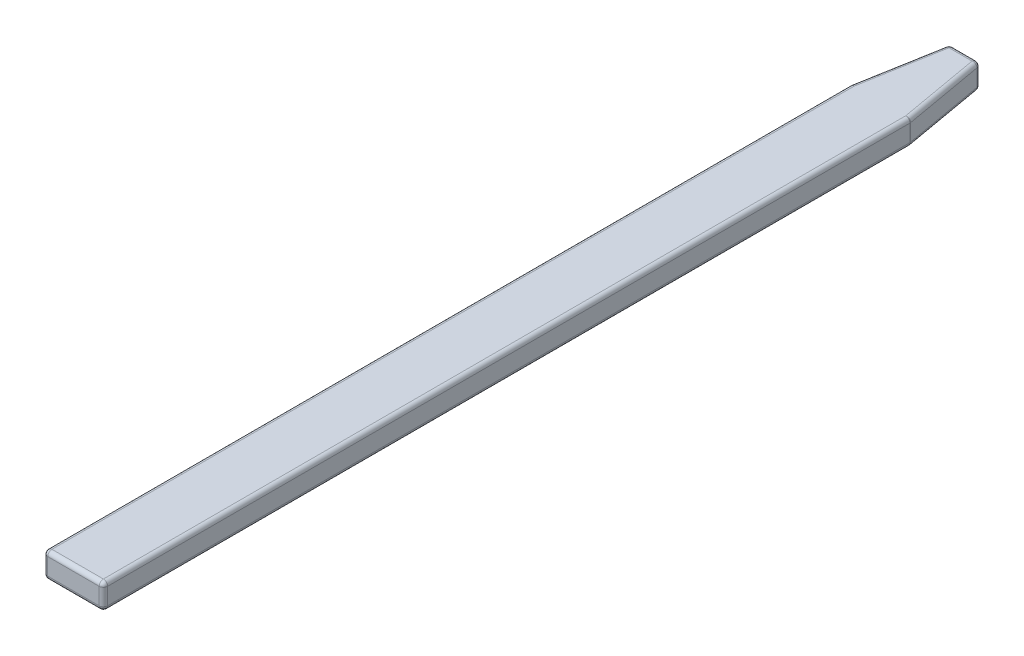
ISO-10303-21;
HEADER;
FILE_DESCRIPTION(('STEP AP214'),'2;1');
FILE_NAME('part.step','',(''),(''),'','','');
FILE_SCHEMA(('AUTOMOTIVE_DESIGN { 1 0 10303 214 1 1 1 1 }'));
ENDSEC;
DATA;
#1=APPLICATION_CONTEXT('core data for automotive mechanical design processes');
#2=APPLICATION_PROTOCOL_DEFINITION('international standard','automotive_design',2000,#1);
#3=PRODUCT_CONTEXT('',#1,'mechanical');
#4=PRODUCT('Part','Part','',(#3));
#5=PRODUCT_RELATED_PRODUCT_CATEGORY('part','',(#4));
#6=PRODUCT_DEFINITION_FORMATION('','',#4);
#7=PRODUCT_DEFINITION_CONTEXT('part definition',#1,'design');
#8=PRODUCT_DEFINITION('design','',#6,#7);
#9=PRODUCT_DEFINITION_SHAPE('','',#8);
#10=(LENGTH_UNIT() NAMED_UNIT(*) SI_UNIT(.MILLI.,.METRE.));
#11=(NAMED_UNIT(*) PLANE_ANGLE_UNIT() SI_UNIT($,.RADIAN.));
#12=(NAMED_UNIT(*) SI_UNIT($,.STERADIAN.) SOLID_ANGLE_UNIT());
#13=UNCERTAINTY_MEASURE_WITH_UNIT(LENGTH_MEASURE(1.E-05),#10,'distance_accuracy_value','');
#14=(GEOMETRIC_REPRESENTATION_CONTEXT(3) GLOBAL_UNCERTAINTY_ASSIGNED_CONTEXT((#13)) GLOBAL_UNIT_ASSIGNED_CONTEXT((#10,
#11,#12)) REPRESENTATION_CONTEXT('',''));
#15=CARTESIAN_POINT('',(0.,0.,0.));
#16=DIRECTION('',(0.,0.,1.));
#17=DIRECTION('',(1.,0.,0.));
#18=AXIS2_PLACEMENT_3D('',#15,#16,#17);
#19=CARTESIAN_POINT('',(-0.305000000000003,0.0999469366672912,-2.50962556682371));
#20=DIRECTION('',(0.,0.,1.));
#21=DIRECTION('',(1.,0.,0.));
#22=AXIS2_PLACEMENT_3D('',#19,#20,#21);
#23=SPHERICAL_SURFACE('',#22,0.05);
#24=CARTESIAN_POINT('',(-0.305000000000003,0.0999469366672912,-2.5096255668237));
#25=DIRECTION('',(0.,0.,-1.));
#26=DIRECTION('',(0.,1.,0.));
#27=AXIS2_PLACEMENT_3D('',#24,#25,#26);
#28=CIRCLE('',#27,0.05);
#29=CARTESIAN_POINT('',(-0.355000000000003,0.0999469366672913,-2.50962556682371));
#30=VERTEX_POINT('',#29);
#31=CARTESIAN_POINT('',(-0.305000000000003,0.149946936667291,-2.50962556682371));
#32=VERTEX_POINT('',#31);
#33=EDGE_CURVE('E11',#30,#32,#28,.T.);
#34=ORIENTED_EDGE('',*,*,#33,.T.);
#35=CARTESIAN_POINT('',(-0.305000000000003,0.0999469366672912,-2.50962556682371));
#36=DIRECTION('',(-0.173648177666919,0.,0.98480775301221));
#37=DIRECTION('',(-0.98480775301221,0.,-0.173648177666919));
#38=AXIS2_PLACEMENT_3D('',#35,#36,#37);
#39=CIRCLE('',#38,0.05);
#40=CARTESIAN_POINT('',(-0.354240387650613,0.0999469366672912,-2.51830797570705));
#41=VERTEX_POINT('',#40);
#42=EDGE_CURVE('E24',#32,#41,#39,.T.);
#43=ORIENTED_EDGE('',*,*,#42,.T.);
#44=CARTESIAN_POINT('',(-0.305000000000003,0.0999469366672912,-2.50962556682371));
#45=DIRECTION('',(0.,1.,0.));
#46=DIRECTION('',(-1.,0.,0.));
#47=AXIS2_PLACEMENT_3D('',#44,#45,#46);
#48=CIRCLE('',#47,0.0499999999999999);
#49=EDGE_CURVE('E284',#41,#30,#48,.T.);
#50=ORIENTED_EDGE('',*,*,#49,.T.);
#51=EDGE_LOOP('',(#34,#43,#50));
#52=FACE_BOUND('',#51,.T.);
#53=ADVANCED_FACE('F17',(#52),#23,.T.);
#54=CARTESIAN_POINT('',(-0.136718037732674,0.0999469366672912,-3.464));
#55=DIRECTION('',(-0.351334189452769,-0.837407564962996,-0.418703782481496));
#56=DIRECTION('',(-0.538275207016001,0.54657896972235,-0.641491411765688));
#57=AXIS2_PLACEMENT_3D('',#54,#55,#56);
#58=SPHERICAL_SURFACE('',#57,0.05);
#59=CARTESIAN_POINT('',(-0.136718037732674,0.0999469366672912,-3.464));
#60=DIRECTION('',(0.,1.,0.));
#61=DIRECTION('',(-0.984807753012208,0.,-0.17364817766693));
#62=AXIS2_PLACEMENT_3D('',#59,#60,#61);
#63=CIRCLE('',#62,0.05);
#64=CARTESIAN_POINT('',(-0.136718037732674,0.0999469366672912,-3.514));
#65=VERTEX_POINT('',#64);
#66=CARTESIAN_POINT('',(-0.185958425383284,0.0999469366672912,-3.47268240888335));
#67=VERTEX_POINT('',#66);
#68=EDGE_CURVE('E282',#65,#67,#63,.T.);
#69=ORIENTED_EDGE('',*,*,#68,.T.);
#70=CARTESIAN_POINT('',(-0.136718037732674,0.0999469366672912,-3.464));
#71=DIRECTION('',(0.17364817766694,0.,-0.984807753012206));
#72=DIRECTION('',(0.,1.,0.));
#73=AXIS2_PLACEMENT_3D('',#70,#71,#72);
#74=CIRCLE('',#73,0.05);
#75=CARTESIAN_POINT('',(-0.136718037732674,0.149946936667291,-3.464));
#76=VERTEX_POINT('',#75);
#77=EDGE_CURVE('E280',#67,#76,#74,.T.);
#78=ORIENTED_EDGE('',*,*,#77,.T.);
#79=CARTESIAN_POINT('',(-0.136718037732674,0.0999469366672912,-3.464));
#80=DIRECTION('',(-1.,0.,0.));
#81=DIRECTION('',(0.,0.,-1.));
#82=AXIS2_PLACEMENT_3D('',#79,#80,#81);
#83=CIRCLE('',#82,0.05);
#84=EDGE_CURVE('E277',#76,#65,#83,.T.);
#85=ORIENTED_EDGE('',*,*,#84,.T.);
#86=EDGE_LOOP('',(#69,#78,#85));
#87=FACE_BOUND('',#86,.T.);
#88=ADVANCED_FACE('F448',(#87),#58,.T.);
#89=CARTESIAN_POINT('',(-1.10906299365398,0.0999469366672912,2.0504422709135));
#90=DIRECTION('',(-0.17364817766693,0.,0.984807753012208));
#91=DIRECTION('',(-0.696364240320019,0.707106781186548,-0.122787803968973));
#92=AXIS2_PLACEMENT_3D('',#89,#90,#91);
#93=CYLINDRICAL_SURFACE('',#92,0.05);
#94=ORIENTED_EDGE('',*,*,#42,.F.);
#95=DIRECTION('',(0.17364817766693,0.,-0.984807753012208));
#96=VECTOR('',#95,1.);
#97=CARTESIAN_POINT('',(-1.10906299365398,0.149946936667291,2.0504422709135));
#98=LINE('',#97,#96);
#99=EDGE_CURVE('E274',#32,#76,#98,.T.);
#100=ORIENTED_EDGE('',*,*,#99,.T.);
#101=ORIENTED_EDGE('',*,*,#77,.F.);
#102=DIRECTION('',(-0.17364817766693,0.,0.984807753012208));
#103=VECTOR('',#102,1.);
#104=CARTESIAN_POINT('',(-1.15830338130459,0.0999469366672912,2.04175986203016));
#105=LINE('',#104,#103);
#106=EDGE_CURVE('E271',#67,#41,#105,.T.);
#107=ORIENTED_EDGE('',*,*,#106,.T.);
#108=EDGE_LOOP('',(#94,#100,#101,#107));
#109=FACE_BOUND('',#108,.T.);
#110=ADVANCED_FACE('F300',(#109),#93,.T.);
#111=CARTESIAN_POINT('',(-0.305000000000003,-0.100053063332709,-2.5096255668237));
#112=DIRECTION('',(0.,0.,1.));
#113=DIRECTION('',(1.,0.,0.));
#114=AXIS2_PLACEMENT_3D('',#111,#112,#113);
#115=SPHERICAL_SURFACE('',#114,0.05);
#116=CARTESIAN_POINT('',(-0.305000000000003,-0.100053063332709,-2.50962556682371));
#117=DIRECTION('',(-0.173648177666918,0.,0.98480775301221));
#118=DIRECTION('',(0.,-1.,0.));
#119=AXIS2_PLACEMENT_3D('',#116,#117,#118);
#120=CIRCLE('',#119,0.05);
#121=CARTESIAN_POINT('',(-0.354240387650613,-0.100053063332709,-2.51830797570705));
#122=VERTEX_POINT('',#121);
#123=CARTESIAN_POINT('',(-0.305000000000003,-0.150053063332709,-2.5096255668237));
#124=VERTEX_POINT('',#123);
#125=EDGE_CURVE('E269',#122,#124,#120,.T.);
#126=ORIENTED_EDGE('',*,*,#125,.T.);
#127=CARTESIAN_POINT('',(-0.305000000000003,-0.100053063332709,-2.5096255668237));
#128=DIRECTION('',(0.,0.,-1.));
#129=DIRECTION('',(-1.,0.,0.));
#130=AXIS2_PLACEMENT_3D('',#127,#128,#129);
#131=CIRCLE('',#130,0.05);
#132=CARTESIAN_POINT('',(-0.355000000000003,-0.100053063332709,-2.5096255668237));
#133=VERTEX_POINT('',#132);
#134=EDGE_CURVE('E267',#124,#133,#131,.T.);
#135=ORIENTED_EDGE('',*,*,#134,.T.);
#136=CARTESIAN_POINT('',(-0.305000000000003,-0.100053063332709,-2.5096255668237));
#137=DIRECTION('',(0.,-1.,0.));
#138=DIRECTION('',(-0.984807753012208,0.,-0.173648177666929));
#139=AXIS2_PLACEMENT_3D('',#136,#137,#138);
#140=CIRCLE('',#139,0.0500000000000001);
#141=EDGE_CURVE('E264',#133,#122,#140,.T.);
#142=ORIENTED_EDGE('',*,*,#141,.T.);
#143=EDGE_LOOP('',(#126,#135,#142));
#144=FACE_BOUND('',#143,.T.);
#145=ADVANCED_FACE('F436',(#144),#115,.T.);
#146=CARTESIAN_POINT('',(-0.305000000000003,0.0999469366672912,7.006));
#147=DIRECTION('',(-0.816496580927727,-0.408248290463864,-0.40824829046386));
#148=DIRECTION('',(-0.577350269189624,0.577350269189628,0.577350269189625));
#149=AXIS2_PLACEMENT_3D('',#146,#147,#148);
#150=SPHERICAL_SURFACE('',#149,0.05);
#151=CARTESIAN_POINT('',(-0.305000000000003,0.0999469366672912,7.006));
#152=DIRECTION('',(-1.,0.,0.));
#153=DIRECTION('',(0.,1.,0.));
#154=AXIS2_PLACEMENT_3D('',#151,#152,#153);
#155=CIRCLE('',#154,0.05);
#156=CARTESIAN_POINT('',(-0.305000000000003,0.0999469366672912,7.056));
#157=VERTEX_POINT('',#156);
#158=CARTESIAN_POINT('',(-0.305000000000003,0.149946936667291,7.006));
#159=VERTEX_POINT('',#158);
#160=EDGE_CURVE('E262',#157,#159,#155,.T.);
#161=ORIENTED_EDGE('',*,*,#160,.T.);
#162=CARTESIAN_POINT('',(-0.305000000000003,0.0999469366672912,7.006));
#163=DIRECTION('',(0.,0.,1.));
#164=DIRECTION('',(-1.,0.,0.));
#165=AXIS2_PLACEMENT_3D('',#162,#163,#164);
#166=CIRCLE('',#165,0.05);
#167=CARTESIAN_POINT('',(-0.355000000000003,0.0999469366672913,7.006));
#168=VERTEX_POINT('',#167);
#169=EDGE_CURVE('E260',#159,#168,#166,.T.);
#170=ORIENTED_EDGE('',*,*,#169,.T.);
#171=CARTESIAN_POINT('',(-0.305000000000003,0.0999469366672912,7.006));
#172=DIRECTION('',(0.,1.,0.));
#173=DIRECTION('',(0.,0.,1.));
#174=AXIS2_PLACEMENT_3D('',#171,#172,#173);
#175=CIRCLE('',#174,0.05);
#176=EDGE_CURVE('E257',#168,#157,#175,.T.);
#177=ORIENTED_EDGE('',*,*,#176,.T.);
#178=EDGE_LOOP('',(#161,#170,#177));
#179=FACE_BOUND('',#178,.T.);
#180=ADVANCED_FACE('F434',(#179),#150,.T.);
#181=CARTESIAN_POINT('',(-0.305000000000003,0.0999469366672912,7.006));
#182=DIRECTION('',(0.,0.,-1.));
#183=DIRECTION('',(-0.707106781186547,0.707106781186548,0.));
#184=AXIS2_PLACEMENT_3D('',#181,#182,#183);
#185=CYLINDRICAL_SURFACE('',#184,0.05);
#186=ORIENTED_EDGE('',*,*,#33,.F.);
#187=DIRECTION('',(0.,0.,1.));
#188=VECTOR('',#187,1.);
#189=CARTESIAN_POINT('',(-0.355000000000003,0.0999469366672913,7.006));
#190=LINE('',#189,#188);
#191=EDGE_CURVE('E255',#30,#168,#190,.T.);
#192=ORIENTED_EDGE('',*,*,#191,.T.);
#193=ORIENTED_EDGE('',*,*,#169,.F.);
#194=DIRECTION('',(0.,0.,-1.));
#195=VECTOR('',#194,1.);
#196=CARTESIAN_POINT('',(-0.305000000000003,0.149946936667291,7.006));
#197=LINE('',#196,#195);
#198=EDGE_CURVE('E253',#159,#32,#197,.T.);
#199=ORIENTED_EDGE('',*,*,#198,.T.);
#200=EDGE_LOOP('',(#186,#192,#193,#199));
#201=FACE_BOUND('',#200,.T.);
#202=ADVANCED_FACE('F432',(#201),#185,.T.);
#203=CARTESIAN_POINT('',(-0.136718037732674,-0.100053063332709,-3.464));
#204=DIRECTION('',(0.351334189452759,-0.837407564963,0.418703782481496));
#205=DIRECTION('',(-0.538275207015996,-0.546578969722344,-0.641491411765698));
#206=AXIS2_PLACEMENT_3D('',#203,#204,#205);
#207=SPHERICAL_SURFACE('',#206,0.05);
#208=CARTESIAN_POINT('',(-0.136718037732674,-0.100053063332709,-3.464));
#209=DIRECTION('',(0.,-1.,0.));
#210=DIRECTION('',(0.,0.,-1.));
#211=AXIS2_PLACEMENT_3D('',#208,#209,#210);
#212=CIRCLE('',#211,0.05);
#213=CARTESIAN_POINT('',(-0.185958425383285,-0.100053063332709,-3.47268240888335));
#214=VERTEX_POINT('',#213);
#215=CARTESIAN_POINT('',(-0.136718037732674,-0.100053063332709,-3.514));
#216=VERTEX_POINT('',#215);
#217=EDGE_CURVE('E251',#214,#216,#212,.T.);
#218=ORIENTED_EDGE('',*,*,#217,.T.);
#219=CARTESIAN_POINT('',(-0.136718037732674,-0.100053063332709,-3.464));
#220=DIRECTION('',(-1.,0.,0.));
#221=DIRECTION('',(0.,-1.,0.));
#222=AXIS2_PLACEMENT_3D('',#219,#220,#221);
#223=CIRCLE('',#222,0.05);
#224=CARTESIAN_POINT('',(-0.136718037732674,-0.150053063332709,-3.464));
#225=VERTEX_POINT('',#224);
#226=EDGE_CURVE('E249',#216,#225,#223,.T.);
#227=ORIENTED_EDGE('',*,*,#226,.T.);
#228=CARTESIAN_POINT('',(-0.136718037732674,-0.100053063332709,-3.464));
#229=DIRECTION('',(0.173648177666929,0.,-0.984807753012208));
#230=DIRECTION('',(-0.984807753012208,0.,-0.173648177666929));
#231=AXIS2_PLACEMENT_3D('',#228,#229,#230);
#232=CIRCLE('',#231,0.0500000000000002);
#233=EDGE_CURVE('E246',#225,#214,#232,.T.);
#234=ORIENTED_EDGE('',*,*,#233,.T.);
#235=EDGE_LOOP('',(#218,#227,#234));
#236=FACE_BOUND('',#235,.T.);
#237=ADVANCED_FACE('F443',(#236),#207,.T.);
#238=CARTESIAN_POINT('',(0.136718037732668,0.0999469366672912,-3.464));
#239=DIRECTION('',(0.351334189452757,-0.837407564962997,-0.418703782481504));
#240=DIRECTION('',(0.538275207015987,0.546578969722349,-0.641491411765701));
#241=AXIS2_PLACEMENT_3D('',#238,#239,#240);
#242=SPHERICAL_SURFACE('',#241,0.05);
#243=CARTESIAN_POINT('',(0.136718037732668,0.0999469366672912,-3.464));
#244=DIRECTION('',(0.,1.,0.));
#245=DIRECTION('',(0.,0.,-1.));
#246=AXIS2_PLACEMENT_3D('',#243,#244,#245);
#247=CIRCLE('',#246,0.05);
#248=CARTESIAN_POINT('',(0.185958425383278,0.0999469366672912,-3.47268240888335));
#249=VERTEX_POINT('',#248);
#250=CARTESIAN_POINT('',(0.136718037732668,0.0999469366672912,-3.514));
#251=VERTEX_POINT('',#250);
#252=EDGE_CURVE('E244',#249,#251,#247,.T.);
#253=ORIENTED_EDGE('',*,*,#252,.T.);
#254=CARTESIAN_POINT('',(0.136718037732668,0.0999469366672912,-3.464));
#255=DIRECTION('',(1.,0.,0.));
#256=DIRECTION('',(0.,1.,0.));
#257=AXIS2_PLACEMENT_3D('',#254,#255,#256);
#258=CIRCLE('',#257,0.05);
#259=CARTESIAN_POINT('',(0.136718037732668,0.149946936667291,-3.464));
#260=VERTEX_POINT('',#259);
#261=EDGE_CURVE('E242',#251,#260,#258,.T.);
#262=ORIENTED_EDGE('',*,*,#261,.T.);
#263=CARTESIAN_POINT('',(0.136718037732668,0.0999469366672912,-3.464));
#264=DIRECTION('',(-0.17364817766692,0.,-0.98480775301221));
#265=DIRECTION('',(0.98480775301221,0.,-0.17364817766692));
#266=AXIS2_PLACEMENT_3D('',#263,#264,#265);
#267=CIRCLE('',#266,0.0499999999999997);
#268=EDGE_CURVE('E239',#260,#249,#267,.T.);
#269=ORIENTED_EDGE('',*,*,#268,.T.);
#270=EDGE_LOOP('',(#253,#262,#269));
#271=FACE_BOUND('',#270,.T.);
#272=ADVANCED_FACE('F462',(#271),#242,.T.);
#273=CARTESIAN_POINT('',(-0.947500000000003,0.0999469366672912,-3.464));
#274=DIRECTION('',(-1.,0.,0.));
#275=DIRECTION('',(0.,0.707106781186547,-0.707106781186548));
#276=AXIS2_PLACEMENT_3D('',#273,#274,#275);
#277=CYLINDRICAL_SURFACE('',#276,0.05);
#278=ORIENTED_EDGE('',*,*,#84,.F.);
#279=DIRECTION('',(1.,0.,0.));
#280=VECTOR('',#279,1.);
#281=CARTESIAN_POINT('',(-0.947500000000003,0.149946936667291,-3.464));
#282=LINE('',#281,#280);
#283=EDGE_CURVE('E236',#76,#260,#282,.T.);
#284=ORIENTED_EDGE('',*,*,#283,.T.);
#285=ORIENTED_EDGE('',*,*,#261,.F.);
#286=DIRECTION('',(-1.,0.,0.));
#287=VECTOR('',#286,1.);
#288=CARTESIAN_POINT('',(-0.947500000000003,0.0999469366672912,-3.514));
#289=LINE('',#288,#287);
#290=EDGE_CURVE('E233',#251,#65,#289,.T.);
#291=ORIENTED_EDGE('',*,*,#290,.T.);
#292=EDGE_LOOP('',(#278,#284,#285,#291));
#293=FACE_BOUND('',#292,.T.);
#294=ADVANCED_FACE('F467',(#293),#277,.T.);
#295=CARTESIAN_POINT('',(-0.305000000000003,-0.100053063332709,7.006));
#296=DIRECTION('',(0.408248290463863,-0.816496580927727,-0.40824829046386));
#297=DIRECTION('',(-0.577350269189628,-0.577350269189624,0.577350269189625));
#298=AXIS2_PLACEMENT_3D('',#295,#296,#297);
#299=SPHERICAL_SURFACE('',#298,0.05);
#300=CARTESIAN_POINT('',(-0.305000000000003,-0.100053063332709,7.006));
#301=DIRECTION('',(0.,-1.,0.));
#302=DIRECTION('',(-1.,0.,0.));
#303=AXIS2_PLACEMENT_3D('',#300,#301,#302);
#304=CIRCLE('',#303,0.05);
#305=CARTESIAN_POINT('',(-0.305000000000003,-0.100053063332709,7.056));
#306=VERTEX_POINT('',#305);
#307=CARTESIAN_POINT('',(-0.355000000000003,-0.100053063332709,7.006));
#308=VERTEX_POINT('',#307);
#309=EDGE_CURVE('E231',#306,#308,#304,.T.);
#310=ORIENTED_EDGE('',*,*,#309,.T.);
#311=CARTESIAN_POINT('',(-0.305000000000003,-0.100053063332709,7.006));
#312=DIRECTION('',(0.,0.,1.));
#313=DIRECTION('',(0.,-1.,0.));
#314=AXIS2_PLACEMENT_3D('',#311,#312,#313);
#315=CIRCLE('',#314,0.05);
#316=CARTESIAN_POINT('',(-0.305000000000003,-0.150053063332709,7.006));
#317=VERTEX_POINT('',#316);
#318=EDGE_CURVE('E229',#308,#317,#315,.T.);
#319=ORIENTED_EDGE('',*,*,#318,.T.);
#320=CARTESIAN_POINT('',(-0.305000000000003,-0.100053063332709,7.006));
#321=DIRECTION('',(-1.,0.,0.));
#322=DIRECTION('',(0.,0.,1.));
#323=AXIS2_PLACEMENT_3D('',#320,#321,#322);
#324=CIRCLE('',#323,0.05);
#325=EDGE_CURVE('E226',#317,#306,#324,.T.);
#326=ORIENTED_EDGE('',*,*,#325,.T.);
#327=EDGE_LOOP('',(#310,#319,#326));
#328=FACE_BOUND('',#327,.T.);
#329=ADVANCED_FACE('F426',(#328),#299,.T.);
#330=CARTESIAN_POINT('',(-0.305000000000003,-0.100053063332709,7.006));
#331=DIRECTION('',(0.,0.,1.));
#332=DIRECTION('',(-0.707106781186548,-0.707106781186547,0.));
#333=AXIS2_PLACEMENT_3D('',#330,#331,#332);
#334=CYLINDRICAL_SURFACE('',#333,0.05);
#335=ORIENTED_EDGE('',*,*,#318,.F.);
#336=DIRECTION('',(0.,0.,-1.));
#337=VECTOR('',#336,1.);
#338=CARTESIAN_POINT('',(-0.355000000000003,-0.100053063332709,7.006));
#339=LINE('',#338,#337);
#340=EDGE_CURVE('E223',#308,#133,#339,.T.);
#341=ORIENTED_EDGE('',*,*,#340,.T.);
#342=ORIENTED_EDGE('',*,*,#134,.F.);
#343=DIRECTION('',(0.,0.,1.));
#344=VECTOR('',#343,1.);
#345=CARTESIAN_POINT('',(-0.305000000000003,-0.150053063332709,7.006));
#346=LINE('',#345,#344);
#347=EDGE_CURVE('E220',#124,#317,#346,.T.);
#348=ORIENTED_EDGE('',*,*,#347,.T.);
#349=EDGE_LOOP('',(#335,#341,#342,#348));
#350=FACE_BOUND('',#349,.T.);
#351=ADVANCED_FACE('F428',(#350),#334,.T.);
#352=CARTESIAN_POINT('',(0.304999999999997,0.0999469366672912,7.006));
#353=DIRECTION('',(-0.816496580927727,0.408248290463864,0.40824829046386));
#354=DIRECTION('',(0.577350269189624,0.577350269189628,0.577350269189625));
#355=AXIS2_PLACEMENT_3D('',#352,#353,#354);
#356=SPHERICAL_SURFACE('',#355,0.05);
#357=CARTESIAN_POINT('',(0.304999999999997,0.0999469366672912,7.006));
#358=DIRECTION('',(0.,1.,0.));
#359=DIRECTION('',(1.,0.,0.));
#360=AXIS2_PLACEMENT_3D('',#357,#358,#359);
#361=CIRCLE('',#360,0.05);
#362=CARTESIAN_POINT('',(0.304999999999997,0.0999469366672912,7.056));
#363=VERTEX_POINT('',#362);
#364=CARTESIAN_POINT('',(0.354999999999997,0.0999469366672914,7.006));
#365=VERTEX_POINT('',#364);
#366=EDGE_CURVE('E218',#363,#365,#361,.T.);
#367=ORIENTED_EDGE('',*,*,#366,.T.);
#368=CARTESIAN_POINT('',(0.304999999999997,0.0999469366672912,7.006));
#369=DIRECTION('',(0.,0.,1.));
#370=DIRECTION('',(0.,1.,0.));
#371=AXIS2_PLACEMENT_3D('',#368,#369,#370);
#372=CIRCLE('',#371,0.05);
#373=CARTESIAN_POINT('',(0.304999999999997,0.149946936667291,7.006));
#374=VERTEX_POINT('',#373);
#375=EDGE_CURVE('E216',#365,#374,#372,.T.);
#376=ORIENTED_EDGE('',*,*,#375,.T.);
#377=CARTESIAN_POINT('',(0.304999999999997,0.0999469366672912,7.006));
#378=DIRECTION('',(1.,0.,0.));
#379=DIRECTION('',(0.,0.,1.));
#380=AXIS2_PLACEMENT_3D('',#377,#378,#379);
#381=CIRCLE('',#380,0.05);
#382=EDGE_CURVE('E213',#374,#363,#381,.T.);
#383=ORIENTED_EDGE('',*,*,#382,.T.);
#384=EDGE_LOOP('',(#367,#376,#383));
#385=FACE_BOUND('',#384,.T.);
#386=ADVANCED_FACE('F418',(#385),#356,.T.);
#387=CARTESIAN_POINT('',(0.136718037732668,-0.100053063332709,-3.464));
#388=DIRECTION('',(-0.35133418945276,-0.837407564963,0.418703782481495));
#389=DIRECTION('',(0.538275207015996,-0.546578969722344,-0.641491411765697));
#390=AXIS2_PLACEMENT_3D('',#387,#388,#389);
#391=SPHERICAL_SURFACE('',#390,0.0500000000000001);
#392=CARTESIAN_POINT('',(0.136718037732668,-0.100053063332709,-3.464));
#393=DIRECTION('',(1.,0.,0.));
#394=DIRECTION('',(0.,0.,-1.));
#395=AXIS2_PLACEMENT_3D('',#392,#393,#394);
#396=CIRCLE('',#395,0.05);
#397=CARTESIAN_POINT('',(0.136718037732668,-0.150053063332709,-3.464));
#398=VERTEX_POINT('',#397);
#399=CARTESIAN_POINT('',(0.136718037732668,-0.100053063332709,-3.514));
#400=VERTEX_POINT('',#399);
#401=EDGE_CURVE('E211',#398,#400,#396,.T.);
#402=ORIENTED_EDGE('',*,*,#401,.T.);
#403=CARTESIAN_POINT('',(0.136718037732668,-0.100053063332709,-3.464));
#404=DIRECTION('',(0.,-1.,0.));
#405=DIRECTION('',(0.984807753012208,0.,-0.173648177666929));
#406=AXIS2_PLACEMENT_3D('',#403,#404,#405);
#407=CIRCLE('',#406,0.0500000000000001);
#408=CARTESIAN_POINT('',(0.185958425383278,-0.100053063332709,-3.47268240888335));
#409=VERTEX_POINT('',#408);
#410=EDGE_CURVE('E209',#400,#409,#407,.T.);
#411=ORIENTED_EDGE('',*,*,#410,.T.);
#412=CARTESIAN_POINT('',(0.136718037732668,-0.100053063332709,-3.464));
#413=DIRECTION('',(-0.17364817766693,0.,-0.984807753012208));
#414=DIRECTION('',(0.,-1.,0.));
#415=AXIS2_PLACEMENT_3D('',#412,#413,#414);
#416=CIRCLE('',#415,0.05);
#417=EDGE_CURVE('E206',#409,#398,#416,.T.);
#418=ORIENTED_EDGE('',*,*,#417,.T.);
#419=EDGE_LOOP('',(#402,#411,#418));
#420=FACE_BOUND('',#419,.T.);
#421=ADVANCED_FACE('F389',(#420),#391,.T.);
#422=CARTESIAN_POINT('',(0.136718037732668,-0.075053063332709,-3.464));
#423=DIRECTION('',(0.,-1.,0.));
#424=DIRECTION('',(0.642787609686543,0.,-0.766044443118975));
#425=AXIS2_PLACEMENT_3D('',#422,#423,#424);
#426=CYLINDRICAL_SURFACE('',#425,0.05);
#427=ORIENTED_EDGE('',*,*,#410,.F.);
#428=DIRECTION('',(0.,1.,0.));
#429=VECTOR('',#428,1.);
#430=CARTESIAN_POINT('',(0.136718037732668,-0.075053063332709,-3.514));
#431=LINE('',#430,#429);
#432=EDGE_CURVE('E203',#400,#251,#431,.T.);
#433=ORIENTED_EDGE('',*,*,#432,.T.);
#434=ORIENTED_EDGE('',*,*,#252,.F.);
#435=DIRECTION('',(0.,-1.,0.));
#436=VECTOR('',#435,1.);
#437=CARTESIAN_POINT('',(0.185958425383278,-0.075053063332709,-3.47268240888335));
#438=LINE('',#437,#436);
#439=EDGE_CURVE('E200',#249,#409,#438,.T.);
#440=ORIENTED_EDGE('',*,*,#439,.T.);
#441=EDGE_LOOP('',(#427,#433,#434,#440));
#442=FACE_BOUND('',#441,.T.);
#443=ADVANCED_FACE('F392',(#442),#426,.T.);
#444=CARTESIAN_POINT('',(0.304999999999997,0.0999469366672912,-2.5096255668237));
#445=DIRECTION('',(0.,0.,1.));
#446=DIRECTION('',(1.,0.,0.));
#447=AXIS2_PLACEMENT_3D('',#444,#445,#446);
#448=SPHERICAL_SURFACE('',#447,0.05);
#449=CARTESIAN_POINT('',(0.304999999999997,0.0999469366672912,-2.5096255668237));
#450=DIRECTION('',(0.173648177666942,0.,0.984807753012206));
#451=DIRECTION('',(0.,1.,0.));
#452=AXIS2_PLACEMENT_3D('',#449,#450,#451);
#453=CIRCLE('',#452,0.05);
#454=CARTESIAN_POINT('',(0.354240387650607,0.0999469366672912,-2.51830797570705));
#455=VERTEX_POINT('',#454);
#456=CARTESIAN_POINT('',(0.304999999999997,0.149946936667291,-2.5096255668237));
#457=VERTEX_POINT('',#456);
#458=EDGE_CURVE('E198',#455,#457,#453,.T.);
#459=ORIENTED_EDGE('',*,*,#458,.T.);
#460=CARTESIAN_POINT('',(0.304999999999997,0.0999469366672912,-2.5096255668237));
#461=DIRECTION('',(0.,0.,-1.));
#462=DIRECTION('',(1.,0.,0.));
#463=AXIS2_PLACEMENT_3D('',#460,#461,#462);
#464=CIRCLE('',#463,0.05);
#465=CARTESIAN_POINT('',(0.354999999999997,0.0999469366672914,-2.5096255668237));
#466=VERTEX_POINT('',#465);
#467=EDGE_CURVE('E196',#457,#466,#464,.T.);
#468=ORIENTED_EDGE('',*,*,#467,.T.);
#469=CARTESIAN_POINT('',(0.304999999999997,0.0999469366672912,-2.5096255668237));
#470=DIRECTION('',(0.,1.,0.));
#471=DIRECTION('',(0.984807753012208,0.,-0.17364817766693));
#472=AXIS2_PLACEMENT_3D('',#469,#470,#471);
#473=CIRCLE('',#472,0.0499999999999999);
#474=EDGE_CURVE('E193',#466,#455,#473,.T.);
#475=ORIENTED_EDGE('',*,*,#474,.T.);
#476=EDGE_LOOP('',(#459,#468,#475));
#477=FACE_BOUND('',#476,.T.);
#478=ADVANCED_FACE('F403',(#477),#448,.T.);
#479=CARTESIAN_POINT('',(0.304999999999997,0.0999469366672912,7.006));
#480=DIRECTION('',(0.,0.,1.));
#481=DIRECTION('',(0.707106781186546,0.707106781186549,0.));
#482=AXIS2_PLACEMENT_3D('',#479,#480,#481);
#483=CYLINDRICAL_SURFACE('',#482,0.05);
#484=ORIENTED_EDGE('',*,*,#375,.F.);
#485=DIRECTION('',(0.,0.,-1.));
#486=VECTOR('',#485,1.);
#487=CARTESIAN_POINT('',(0.354999999999997,0.0999469366672914,7.006));
#488=LINE('',#487,#486);
#489=EDGE_CURVE('E190',#365,#466,#488,.T.);
#490=ORIENTED_EDGE('',*,*,#489,.T.);
#491=ORIENTED_EDGE('',*,*,#467,.F.);
#492=DIRECTION('',(0.,0.,1.));
#493=VECTOR('',#492,1.);
#494=CARTESIAN_POINT('',(0.304999999999997,0.149946936667291,7.006));
#495=LINE('',#494,#493);
#496=EDGE_CURVE('E187',#457,#374,#495,.T.);
#497=ORIENTED_EDGE('',*,*,#496,.T.);
#498=EDGE_LOOP('',(#484,#490,#491,#497));
#499=FACE_BOUND('',#498,.T.);
#500=ADVANCED_FACE('F407',(#499),#483,.T.);
#501=CARTESIAN_POINT('',(0.304999999999997,-0.100053063332709,7.006));
#502=DIRECTION('',(0.408248290463867,-0.408248290463864,-0.816496580927723));
#503=DIRECTION('',(0.577350269189626,-0.577350269189622,0.57735026918963));
#504=AXIS2_PLACEMENT_3D('',#501,#502,#503);
#505=SPHERICAL_SURFACE('',#504,0.05);
#506=CARTESIAN_POINT('',(0.304999999999997,-0.100053063332709,7.006));
#507=DIRECTION('',(1.,0.,0.));
#508=DIRECTION('',(0.,-1.,0.));
#509=AXIS2_PLACEMENT_3D('',#506,#507,#508);
#510=CIRCLE('',#509,0.05);
#511=CARTESIAN_POINT('',(0.304999999999997,-0.100053063332709,7.056));
#512=VERTEX_POINT('',#511);
#513=CARTESIAN_POINT('',(0.304999999999997,-0.150053063332709,7.006));
#514=VERTEX_POINT('',#513);
#515=EDGE_CURVE('E185',#512,#514,#510,.T.);
#516=ORIENTED_EDGE('',*,*,#515,.T.);
#517=CARTESIAN_POINT('',(0.304999999999997,-0.100053063332709,7.006));
#518=DIRECTION('',(0.,0.,1.));
#519=DIRECTION('',(1.,0.,0.));
#520=AXIS2_PLACEMENT_3D('',#517,#518,#519);
#521=CIRCLE('',#520,0.05);
#522=CARTESIAN_POINT('',(0.354999999999997,-0.100053063332709,7.006));
#523=VERTEX_POINT('',#522);
#524=EDGE_CURVE('E164',#514,#523,#521,.T.);
#525=ORIENTED_EDGE('',*,*,#524,.T.);
#526=CARTESIAN_POINT('',(0.304999999999997,-0.100053063332709,7.006));
#527=DIRECTION('',(0.,-1.,0.));
#528=DIRECTION('',(0.,0.,1.));
#529=AXIS2_PLACEMENT_3D('',#526,#527,#528);
#530=CIRCLE('',#529,0.05);
#531=EDGE_CURVE('E181',#523,#512,#530,.T.);
#532=ORIENTED_EDGE('',*,*,#531,.T.);
#533=EDGE_LOOP('',(#516,#525,#532));
#534=FACE_BOUND('',#533,.T.);
#535=ADVANCED_FACE('F370',(#534),#505,.T.);
#536=CARTESIAN_POINT('',(0.304999999999997,-0.100053063332709,-2.5096255668237));
#537=DIRECTION('',(0.,0.,1.));
#538=DIRECTION('',(1.,0.,0.));
#539=AXIS2_PLACEMENT_3D('',#536,#537,#538);
#540=SPHERICAL_SURFACE('',#539,0.05);
#541=CARTESIAN_POINT('',(0.304999999999997,-0.100053063332709,-2.5096255668237));
#542=DIRECTION('',(0.,-1.,0.));
#543=DIRECTION('',(1.,0.,0.));
#544=AXIS2_PLACEMENT_3D('',#541,#542,#543);
#545=CIRCLE('',#544,0.0499999999999999);
#546=CARTESIAN_POINT('',(0.354240387650608,-0.100053063332709,-2.51830797570705));
#547=VERTEX_POINT('',#546);
#548=CARTESIAN_POINT('',(0.354999999999997,-0.100053063332709,-2.5096255668237));
#549=VERTEX_POINT('',#548);
#550=EDGE_CURVE('E143',#547,#549,#545,.T.);
#551=ORIENTED_EDGE('',*,*,#550,.T.);
#552=CARTESIAN_POINT('',(0.304999999999997,-0.100053063332709,-2.5096255668237));
#553=DIRECTION('',(0.,0.,-1.));
#554=DIRECTION('',(0.,-1.,0.));
#555=AXIS2_PLACEMENT_3D('',#552,#553,#554);
#556=CIRCLE('',#555,0.05);
#557=CARTESIAN_POINT('',(0.304999999999997,-0.150053063332709,-2.5096255668237));
#558=VERTEX_POINT('',#557);
#559=EDGE_CURVE('E138',#549,#558,#556,.T.);
#560=ORIENTED_EDGE('',*,*,#559,.T.);
#561=CARTESIAN_POINT('',(0.304999999999997,-0.100053063332709,-2.5096255668237));
#562=DIRECTION('',(0.17364817766693,0.,0.984807753012208));
#563=DIRECTION('',(0.984807753012208,0.,-0.17364817766693));
#564=AXIS2_PLACEMENT_3D('',#561,#562,#563);
#565=CIRCLE('',#564,0.0499999999999998);
#566=EDGE_CURVE('E141',#558,#547,#565,.T.);
#567=ORIENTED_EDGE('',*,*,#566,.T.);
#568=EDGE_LOOP('',(#551,#560,#567));
#569=FACE_BOUND('',#568,.T.);
#570=ADVANCED_FACE('F140',(#569),#540,.T.);
#571=CARTESIAN_POINT('',(0.304999999999997,-0.100053063332709,7.006));
#572=DIRECTION('',(0.,0.,1.));
#573=DIRECTION('',(0.707106781186549,-0.707106781186546,0.));
#574=AXIS2_PLACEMENT_3D('',#571,#572,#573);
#575=CYLINDRICAL_SURFACE('',#574,0.05);
#576=ORIENTED_EDGE('',*,*,#524,.F.);
#577=DIRECTION('',(0.,0.,-1.));
#578=VECTOR('',#577,1.);
#579=CARTESIAN_POINT('',(0.304999999999997,-0.150053063332709,7.006));
#580=LINE('',#579,#578);
#581=EDGE_CURVE('E159',#514,#558,#580,.T.);
#582=ORIENTED_EDGE('',*,*,#581,.T.);
#583=ORIENTED_EDGE('',*,*,#559,.F.);
#584=DIRECTION('',(0.,0.,1.));
#585=VECTOR('',#584,1.);
#586=CARTESIAN_POINT('',(0.354999999999997,-0.100053063332709,7.006));
#587=LINE('',#586,#585);
#588=EDGE_CURVE('E168',#549,#523,#587,.T.);
#589=ORIENTED_EDGE('',*,*,#588,.T.);
#590=EDGE_LOOP('',(#576,#582,#583,#589));
#591=FACE_BOUND('',#590,.T.);
#592=ADVANCED_FACE('F163',(#591),#575,.T.);
#593=CARTESIAN_POINT('',(1.02089950329974,-0.100053063332708,1.5504422709135));
#594=DIRECTION('',(0.17364817766693,0.,0.984807753012208));
#595=DIRECTION('',(0.696364240320016,-0.70710678118655,-0.122787803968972));
#596=AXIS2_PLACEMENT_3D('',#593,#594,#595);
#597=CYLINDRICAL_SURFACE('',#596,0.05);
#598=ORIENTED_EDGE('',*,*,#566,.F.);
#599=DIRECTION('',(-0.17364817766693,0.,-0.984807753012208));
#600=VECTOR('',#599,1.);
#601=CARTESIAN_POINT('',(1.02089950329974,-0.150053063332709,1.5504422709135));
#602=LINE('',#601,#600);
#603=EDGE_CURVE('E154',#558,#398,#602,.T.);
#604=ORIENTED_EDGE('',*,*,#603,.T.);
#605=ORIENTED_EDGE('',*,*,#417,.F.);
#606=DIRECTION('',(0.17364817766693,0.,0.984807753012208));
#607=VECTOR('',#606,1.);
#608=CARTESIAN_POINT('',(1.07013989095035,-0.100053063332708,1.54175986203016));
#609=LINE('',#608,#607);
#610=EDGE_CURVE('E157',#409,#547,#609,.T.);
#611=ORIENTED_EDGE('',*,*,#610,.T.);
#612=EDGE_LOOP('',(#598,#604,#605,#611));
#613=FACE_BOUND('',#612,.T.);
#614=ADVANCED_FACE('F151',(#613),#597,.T.);
#615=CARTESIAN_POINT('',(0.304999999999998,-0.150053063332798,-2.5096255668237));
#616=DIRECTION('',(0.,1.,0.));
#617=DIRECTION('',(0.996194698091745,0.,-0.0871557427476635));
#618=AXIS2_PLACEMENT_3D('',#615,#616,#617);
#619=CYLINDRICAL_SURFACE('',#618,0.05);
#620=ORIENTED_EDGE('',*,*,#474,.F.);
#621=DIRECTION('',(0.,-1.,0.));
#622=VECTOR('',#621,1.);
#623=CARTESIAN_POINT('',(0.354999999999998,-0.150053063332798,-2.5096255668237));
#624=LINE('',#623,#622);
#625=EDGE_CURVE('E176',#466,#549,#624,.T.);
#626=ORIENTED_EDGE('',*,*,#625,.T.);
#627=ORIENTED_EDGE('',*,*,#550,.F.);
#628=DIRECTION('',(0.,1.,0.));
#629=VECTOR('',#628,1.);
#630=CARTESIAN_POINT('',(0.354240387650608,-0.150053063332798,-2.51830797570704));
#631=LINE('',#630,#629);
#632=EDGE_CURVE('E353',#547,#455,#631,.T.);
#633=ORIENTED_EDGE('',*,*,#632,.T.);
#634=EDGE_LOOP('',(#620,#626,#627,#633));
#635=FACE_BOUND('',#634,.T.);
#636=ADVANCED_FACE('F359',(#635),#619,.T.);
#637=CARTESIAN_POINT('',(0.304999999999997,-0.0750530633327084,7.006));
#638=DIRECTION('',(0.,1.,0.));
#639=DIRECTION('',(0.707106781186539,0.,0.707106781186556));
#640=AXIS2_PLACEMENT_3D('',#637,#638,#639);
#641=CYLINDRICAL_SURFACE('',#640,0.05);
#642=ORIENTED_EDGE('',*,*,#366,.F.);
#643=DIRECTION('',(0.,-1.,0.));
#644=VECTOR('',#643,1.);
#645=CARTESIAN_POINT('',(0.304999999999997,-0.0750530633327084,7.056));
#646=LINE('',#645,#644);
#647=EDGE_CURVE('E350',#363,#512,#646,.T.);
#648=ORIENTED_EDGE('',*,*,#647,.T.);
#649=ORIENTED_EDGE('',*,*,#531,.F.);
#650=DIRECTION('',(0.,1.,0.));
#651=VECTOR('',#650,1.);
#652=CARTESIAN_POINT('',(0.354999999999997,-0.0750530633327082,7.006));
#653=LINE('',#652,#651);
#654=EDGE_CURVE('E347',#523,#365,#653,.T.);
#655=ORIENTED_EDGE('',*,*,#654,.T.);
#656=EDGE_LOOP('',(#642,#648,#649,#655));
#657=FACE_BOUND('',#656,.T.);
#658=ADVANCED_FACE('F366',(#657),#641,.T.);
#659=CARTESIAN_POINT('',(-0.177500000000003,-0.100053063332709,7.006));
#660=DIRECTION('',(1.,0.,0.));
#661=DIRECTION('',(0.,-0.707106781186539,0.707106781186556));
#662=AXIS2_PLACEMENT_3D('',#659,#660,#661);
#663=CYLINDRICAL_SURFACE('',#662,0.05);
#664=ORIENTED_EDGE('',*,*,#515,.F.);
#665=DIRECTION('',(-1.,0.,0.));
#666=VECTOR('',#665,1.);
#667=CARTESIAN_POINT('',(-0.177500000000003,-0.100053063332709,7.056));
#668=LINE('',#667,#666);
#669=EDGE_CURVE('E344',#512,#306,#668,.T.);
#670=ORIENTED_EDGE('',*,*,#669,.T.);
#671=ORIENTED_EDGE('',*,*,#325,.F.);
#672=DIRECTION('',(1.,0.,0.));
#673=VECTOR('',#672,1.);
#674=CARTESIAN_POINT('',(-0.177500000000003,-0.150053063332709,7.006));
#675=LINE('',#674,#673);
#676=EDGE_CURVE('E342',#317,#514,#675,.T.);
#677=ORIENTED_EDGE('',*,*,#676,.T.);
#678=EDGE_LOOP('',(#664,#670,#671,#677));
#679=FACE_BOUND('',#678,.T.);
#680=ADVANCED_FACE('F372',(#679),#663,.T.);
#681=CARTESIAN_POINT('',(1.03160406311024,0.0999469366672912,1.61115084635381));
#682=DIRECTION('',(-0.17364817766693,0.,-0.984807753012208));
#683=DIRECTION('',(0.696364240320019,0.707106781186548,-0.122787803968973));
#684=AXIS2_PLACEMENT_3D('',#681,#682,#683);
#685=CYLINDRICAL_SURFACE('',#684,0.05);
#686=ORIENTED_EDGE('',*,*,#268,.F.);
#687=DIRECTION('',(0.17364817766693,0.,0.984807753012208));
#688=VECTOR('',#687,1.);
#689=CARTESIAN_POINT('',(1.03160406311024,0.149946936667291,1.61115084635381));
#690=LINE('',#689,#688);
#691=EDGE_CURVE('E339',#260,#457,#690,.T.);
#692=ORIENTED_EDGE('',*,*,#691,.T.);
#693=ORIENTED_EDGE('',*,*,#458,.F.);
#694=DIRECTION('',(-0.17364817766693,0.,-0.984807753012208));
#695=VECTOR('',#694,1.);
#696=CARTESIAN_POINT('',(1.08084445076085,0.0999469366672912,1.60246843747046));
#697=LINE('',#696,#695);
#698=EDGE_CURVE('E336',#455,#249,#697,.T.);
#699=ORIENTED_EDGE('',*,*,#698,.T.);
#700=EDGE_LOOP('',(#686,#692,#693,#699));
#701=FACE_BOUND('',#700,.T.);
#702=ADVANCED_FACE('F399',(#701),#685,.T.);
#703=CARTESIAN_POINT('',(-1.3025,-0.100053063332709,-3.464));
#704=DIRECTION('',(1.,0.,0.));
#705=DIRECTION('',(0.,-0.707106781186547,-0.707106781186548));
#706=AXIS2_PLACEMENT_3D('',#703,#704,#705);
#707=CYLINDRICAL_SURFACE('',#706,0.05);
#708=ORIENTED_EDGE('',*,*,#401,.F.);
#709=DIRECTION('',(-1.,0.,0.));
#710=VECTOR('',#709,1.);
#711=CARTESIAN_POINT('',(-1.3025,-0.150053063332709,-3.464));
#712=LINE('',#711,#710);
#713=EDGE_CURVE('E173',#398,#225,#712,.T.);
#714=ORIENTED_EDGE('',*,*,#713,.T.);
#715=ORIENTED_EDGE('',*,*,#226,.F.);
#716=DIRECTION('',(1.,0.,0.));
#717=VECTOR('',#716,1.);
#718=CARTESIAN_POINT('',(-1.3025,-0.100053063332709,-3.514));
#719=LINE('',#718,#717);
#720=EDGE_CURVE('E332',#216,#400,#719,.T.);
#721=ORIENTED_EDGE('',*,*,#720,.T.);
#722=EDGE_LOOP('',(#708,#714,#715,#721));
#723=FACE_BOUND('',#722,.T.);
#724=ADVANCED_FACE('F385',(#723),#707,.T.);
#725=CARTESIAN_POINT('',(0.177499999999997,0.0999469366672912,7.006));
#726=DIRECTION('',(-1.,0.,0.));
#727=DIRECTION('',(0.,0.707106781186539,0.707106781186556));
#728=AXIS2_PLACEMENT_3D('',#725,#726,#727);
#729=CYLINDRICAL_SURFACE('',#728,0.05);
#730=ORIENTED_EDGE('',*,*,#160,.F.);
#731=DIRECTION('',(1.,0.,0.));
#732=VECTOR('',#731,1.);
#733=CARTESIAN_POINT('',(0.177499999999997,0.0999469366672912,7.056));
#734=LINE('',#733,#732);
#735=EDGE_CURVE('E329',#157,#363,#734,.T.);
#736=ORIENTED_EDGE('',*,*,#735,.T.);
#737=ORIENTED_EDGE('',*,*,#382,.F.);
#738=DIRECTION('',(-1.,0.,0.));
#739=VECTOR('',#738,1.);
#740=CARTESIAN_POINT('',(0.177499999999997,0.149946936667291,7.006));
#741=LINE('',#740,#739);
#742=EDGE_CURVE('E326',#374,#159,#741,.T.);
#743=ORIENTED_EDGE('',*,*,#742,.T.);
#744=EDGE_LOOP('',(#730,#736,#737,#743));
#745=FACE_BOUND('',#744,.T.);
#746=ADVANCED_FACE('F415',(#745),#729,.T.);
#747=CARTESIAN_POINT('',(-0.305000000000003,0.0749469366672914,7.006));
#748=DIRECTION('',(0.,-1.,0.));
#749=DIRECTION('',(-0.707106781186539,0.,0.707106781186556));
#750=AXIS2_PLACEMENT_3D('',#747,#748,#749);
#751=CYLINDRICAL_SURFACE('',#750,0.05);
#752=ORIENTED_EDGE('',*,*,#309,.F.);
#753=DIRECTION('',(0.,1.,0.));
#754=VECTOR('',#753,1.);
#755=CARTESIAN_POINT('',(-0.305000000000003,0.0749469366672914,7.056));
#756=LINE('',#755,#754);
#757=EDGE_CURVE('E323',#306,#157,#756,.T.);
#758=ORIENTED_EDGE('',*,*,#757,.T.);
#759=ORIENTED_EDGE('',*,*,#176,.F.);
#760=DIRECTION('',(0.,-1.,0.));
#761=VECTOR('',#760,1.);
#762=CARTESIAN_POINT('',(-0.355000000000003,0.0749469366672915,7.006));
#763=LINE('',#762,#761);
#764=EDGE_CURVE('E320',#168,#308,#763,.T.);
#765=ORIENTED_EDGE('',*,*,#764,.T.);
#766=EDGE_LOOP('',(#752,#758,#759,#765));
#767=FACE_BOUND('',#766,.T.);
#768=ADVANCED_FACE('F423',(#767),#751,.T.);
#769=CARTESIAN_POINT('',(-1.11976755346448,-0.100053063332709,2.11115084635381));
#770=DIRECTION('',(0.17364817766693,0.,-0.984807753012208));
#771=DIRECTION('',(-0.696364240320021,-0.707106781186546,-0.122787803968973));
#772=AXIS2_PLACEMENT_3D('',#769,#770,#771);
#773=CYLINDRICAL_SURFACE('',#772,0.05);
#774=ORIENTED_EDGE('',*,*,#233,.F.);
#775=DIRECTION('',(-0.17364817766693,0.,0.984807753012208));
#776=VECTOR('',#775,1.);
#777=CARTESIAN_POINT('',(-1.11976755346448,-0.150053063332709,2.11115084635381));
#778=LINE('',#777,#776);
#779=EDGE_CURVE('E317',#225,#124,#778,.T.);
#780=ORIENTED_EDGE('',*,*,#779,.T.);
#781=ORIENTED_EDGE('',*,*,#125,.F.);
#782=DIRECTION('',(0.17364817766693,0.,-0.984807753012208));
#783=VECTOR('',#782,1.);
#784=CARTESIAN_POINT('',(-1.16900794111509,-0.100053063332709,2.10246843747046));
#785=LINE('',#784,#783);
#786=EDGE_CURVE('E307',#122,#214,#785,.T.);
#787=ORIENTED_EDGE('',*,*,#786,.T.);
#788=EDGE_LOOP('',(#774,#780,#781,#787));
#789=FACE_BOUND('',#788,.T.);
#790=ADVANCED_FACE('F381',(#789),#773,.T.);
#791=CARTESIAN_POINT('',(-0.136718037732674,-0.075053063332709,-3.464));
#792=DIRECTION('',(0.,1.,0.));
#793=DIRECTION('',(-0.642787609686542,0.,-0.766044443118976));
#794=AXIS2_PLACEMENT_3D('',#791,#792,#793);
#795=CYLINDRICAL_SURFACE('',#794,0.05);
#796=ORIENTED_EDGE('',*,*,#68,.F.);
#797=DIRECTION('',(0.,-1.,0.));
#798=VECTOR('',#797,1.);
#799=CARTESIAN_POINT('',(-0.136718037732674,-0.075053063332709,-3.514));
#800=LINE('',#799,#798);
#801=EDGE_CURVE('E313',#65,#216,#800,.T.);
#802=ORIENTED_EDGE('',*,*,#801,.T.);
#803=ORIENTED_EDGE('',*,*,#217,.F.);
#804=DIRECTION('',(0.,1.,0.));
#805=VECTOR('',#804,1.);
#806=CARTESIAN_POINT('',(-0.185958425383285,-0.075053063332709,-3.47268240888335));
#807=LINE('',#806,#805);
#808=EDGE_CURVE('E309',#214,#67,#807,.T.);
#809=ORIENTED_EDGE('',*,*,#808,.T.);
#810=EDGE_LOOP('',(#796,#802,#803,#809));
#811=FACE_BOUND('',#810,.T.);
#812=ADVANCED_FACE('F459',(#811),#795,.T.);
#813=CARTESIAN_POINT('',(-0.305000000000003,-5.30633327589309E-05,-2.5096255668237));
#814=DIRECTION('',(0.,-1.,0.));
#815=DIRECTION('',(-0.996194698091745,0.,-0.0871557427476633));
#816=AXIS2_PLACEMENT_3D('',#813,#814,#815);
#817=CYLINDRICAL_SURFACE('',#816,0.05);
#818=ORIENTED_EDGE('',*,*,#141,.F.);
#819=DIRECTION('',(0.,1.,0.));
#820=VECTOR('',#819,1.);
#821=CARTESIAN_POINT('',(-0.355000000000003,-5.30633327588384E-05,-2.5096255668237));
#822=LINE('',#821,#820);
#823=EDGE_CURVE('E297',#133,#30,#822,.T.);
#824=ORIENTED_EDGE('',*,*,#823,.T.);
#825=ORIENTED_EDGE('',*,*,#49,.F.);
#826=DIRECTION('',(0.,-1.,0.));
#827=VECTOR('',#826,1.);
#828=CARTESIAN_POINT('',(-0.354240387650613,-5.30633327589309E-05,-2.51830797570705));
#829=LINE('',#828,#827);
#830=EDGE_CURVE('E295',#41,#122,#829,.T.);
#831=ORIENTED_EDGE('',*,*,#830,.T.);
#832=EDGE_LOOP('',(#818,#824,#825,#831));
#833=FACE_BOUND('',#832,.T.);
#834=ADVANCED_FACE('F293',(#833),#817,.T.);
#835=CARTESIAN_POINT('',(-2.25,-5.30633327089358E-05,-3.514));
#836=DIRECTION('',(0.,0.,1.));
#837=DIRECTION('',(1.,0.,0.));
#838=AXIS2_PLACEMENT_3D('',#835,#836,#837);
#839=PLANE('',#838);
#840=ORIENTED_EDGE('',*,*,#290,.F.);
#841=ORIENTED_EDGE('',*,*,#432,.F.);
#842=ORIENTED_EDGE('',*,*,#720,.F.);
#843=ORIENTED_EDGE('',*,*,#801,.F.);
#844=EDGE_LOOP('',(#840,#841,#842,#843));
#845=FACE_BOUND('',#844,.T.);
#846=ADVANCED_FACE('F516',(#845),#839,.F.);
#847=CARTESIAN_POINT('',(-0.355000000000003,0.149946936667291,7.006));
#848=DIRECTION('',(-1.,0.,0.));
#849=DIRECTION('',(0.,-1.,0.));
#850=AXIS2_PLACEMENT_3D('',#847,#848,#849);
#851=PLANE('',#850);
#852=ORIENTED_EDGE('',*,*,#340,.F.);
#853=ORIENTED_EDGE('',*,*,#764,.F.);
#854=ORIENTED_EDGE('',*,*,#191,.F.);
#855=ORIENTED_EDGE('',*,*,#823,.F.);
#856=EDGE_LOOP('',(#852,#853,#854,#855));
#857=FACE_BOUND('',#856,.T.);
#858=ADVANCED_FACE('F430',(#857),#851,.T.);
#859=CARTESIAN_POINT('',(0.178673019291532,-0.150053063332709,-3.514));
#860=DIRECTION('',(-0.984807753012208,0.,0.17364817766693));
#861=DIRECTION('',(0.17364817766693,0.,0.984807753012208));
#862=AXIS2_PLACEMENT_3D('',#859,#860,#861);
#863=PLANE('',#862);
#864=ORIENTED_EDGE('',*,*,#439,.F.);
#865=ORIENTED_EDGE('',*,*,#698,.F.);
#866=ORIENTED_EDGE('',*,*,#632,.F.);
#867=ORIENTED_EDGE('',*,*,#610,.F.);
#868=EDGE_LOOP('',(#864,#865,#866,#867));
#869=FACE_BOUND('',#868,.T.);
#870=ADVANCED_FACE('F396',(#869),#863,.F.);
#871=CARTESIAN_POINT('',(0.354999999999996,0.149946936667291,7.006));
#872=DIRECTION('',(0.,1.,0.));
#873=DIRECTION('',(-1.,0.,0.));
#874=AXIS2_PLACEMENT_3D('',#871,#872,#873);
#875=PLANE('',#874);
#876=ORIENTED_EDGE('',*,*,#496,.F.);
#877=ORIENTED_EDGE('',*,*,#691,.F.);
#878=ORIENTED_EDGE('',*,*,#283,.F.);
#879=ORIENTED_EDGE('',*,*,#99,.F.);
#880=ORIENTED_EDGE('',*,*,#198,.F.);
#881=ORIENTED_EDGE('',*,*,#742,.F.);
#882=EDGE_LOOP('',(#876,#877,#878,#879,#880,#881));
#883=FACE_BOUND('',#882,.T.);
#884=ADVANCED_FACE('F410',(#883),#875,.T.);
#885=CARTESIAN_POINT('',(0.354999999999998,-0.150053063332709,7.006));
#886=DIRECTION('',(1.,0.,0.));
#887=DIRECTION('',(0.,1.,0.));
#888=AXIS2_PLACEMENT_3D('',#885,#886,#887);
#889=PLANE('',#888);
#890=ORIENTED_EDGE('',*,*,#588,.F.);
#891=ORIENTED_EDGE('',*,*,#625,.F.);
#892=ORIENTED_EDGE('',*,*,#489,.F.);
#893=ORIENTED_EDGE('',*,*,#654,.F.);
#894=EDGE_LOOP('',(#890,#891,#892,#893));
#895=FACE_BOUND('',#894,.T.);
#896=ADVANCED_FACE('F362',(#895),#889,.T.);
#897=CARTESIAN_POINT('',(-0.355000000000003,-0.150053063332709,7.006));
#898=DIRECTION('',(0.,-1.,0.));
#899=DIRECTION('',(1.,0.,0.));
#900=AXIS2_PLACEMENT_3D('',#897,#898,#899);
#901=PLANE('',#900);
#902=ORIENTED_EDGE('',*,*,#581,.F.);
#903=ORIENTED_EDGE('',*,*,#676,.F.);
#904=ORIENTED_EDGE('',*,*,#347,.F.);
#905=ORIENTED_EDGE('',*,*,#779,.F.);
#906=ORIENTED_EDGE('',*,*,#713,.F.);
#907=ORIENTED_EDGE('',*,*,#603,.F.);
#908=EDGE_LOOP('',(#902,#903,#904,#905,#906,#907));
#909=FACE_BOUND('',#908,.T.);
#910=ADVANCED_FACE('F170',(#909),#901,.T.);
#911=CARTESIAN_POINT('',(0.,-5.30633327089358E-05,7.056));
#912=DIRECTION('',(0.,0.,1.));
#913=DIRECTION('',(1.,0.,0.));
#914=AXIS2_PLACEMENT_3D('',#911,#912,#913);
#915=PLANE('',#914);
#916=ORIENTED_EDGE('',*,*,#647,.F.);
#917=ORIENTED_EDGE('',*,*,#735,.F.);
#918=ORIENTED_EDGE('',*,*,#757,.F.);
#919=ORIENTED_EDGE('',*,*,#669,.F.);
#920=EDGE_LOOP('',(#916,#917,#918,#919));
#921=FACE_BOUND('',#920,.T.);
#922=ADVANCED_FACE('F420',(#921),#915,.T.);
#923=CARTESIAN_POINT('',(-0.355000000000003,-0.150053063332709,-2.514));
#924=DIRECTION('',(0.984807753012208,0.,0.17364817766693));
#925=DIRECTION('',(0.17364817766693,0.,-0.984807753012208));
#926=AXIS2_PLACEMENT_3D('',#923,#924,#925);
#927=PLANE('',#926);
#928=ORIENTED_EDGE('',*,*,#786,.F.);
#929=ORIENTED_EDGE('',*,*,#830,.F.);
#930=ORIENTED_EDGE('',*,*,#106,.F.);
#931=ORIENTED_EDGE('',*,*,#808,.F.);
#932=EDGE_LOOP('',(#928,#929,#930,#931));
#933=FACE_BOUND('',#932,.T.);
#934=ADVANCED_FACE('F305',(#933),#927,.F.);
#935=CLOSED_SHELL('',(#53,#88,#110,#145,#180,#202,#237,#272,#294,#329,#351,#386,#421,#443,#478,
#500,#535,#570,#592,#614,#636,#658,#680,#702,#724,#746,#768,#790,#812,#834,#846,#858,#870,#884,
#896,#910,#922,#934));
#936=MANIFOLD_SOLID_BREP('B1',#935);
#937=ADVANCED_BREP_SHAPE_REPRESENTATION('',(#18,#936),#14);
#938=SHAPE_DEFINITION_REPRESENTATION(#9,#937);
ENDSEC;
END-ISO-10303-21;
